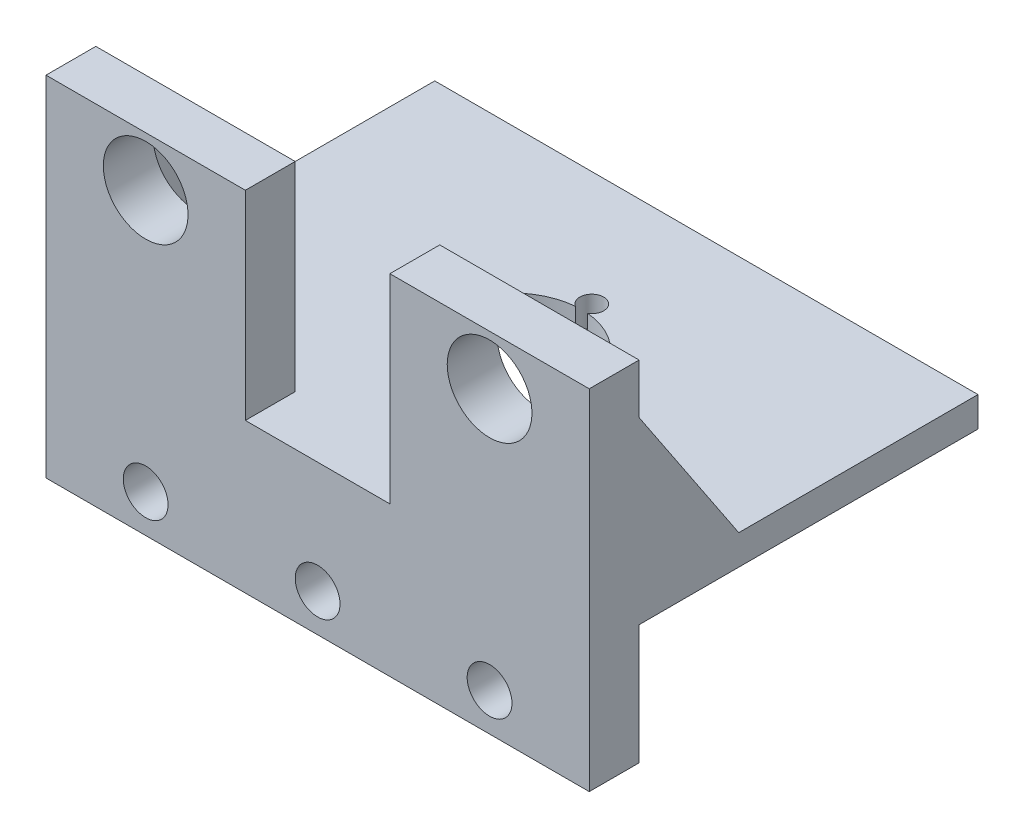
ISO-10303-21;
HEADER;
FILE_DESCRIPTION(('STEP AP214'),'2;1');
FILE_NAME('part.step','',(''),(''),'','','');
FILE_SCHEMA(('AUTOMOTIVE_DESIGN { 1 0 10303 214 1 1 1 1 }'));
ENDSEC;
DATA;
#1=APPLICATION_CONTEXT('core data for automotive mechanical design processes');
#2=APPLICATION_PROTOCOL_DEFINITION('international standard','automotive_design',2000,#1);
#3=PRODUCT_CONTEXT('',#1,'mechanical');
#4=PRODUCT('Part','Part','',(#3));
#5=PRODUCT_RELATED_PRODUCT_CATEGORY('part','',(#4));
#6=PRODUCT_DEFINITION_FORMATION('','',#4);
#7=PRODUCT_DEFINITION_CONTEXT('part definition',#1,'design');
#8=PRODUCT_DEFINITION('design','',#6,#7);
#9=PRODUCT_DEFINITION_SHAPE('','',#8);
#10=(LENGTH_UNIT() NAMED_UNIT(*) SI_UNIT(.MILLI.,.METRE.));
#11=(NAMED_UNIT(*) PLANE_ANGLE_UNIT() SI_UNIT($,.RADIAN.));
#12=(NAMED_UNIT(*) SI_UNIT($,.STERADIAN.) SOLID_ANGLE_UNIT());
#13=UNCERTAINTY_MEASURE_WITH_UNIT(LENGTH_MEASURE(1.E-05),#10,'distance_accuracy_value','');
#14=(GEOMETRIC_REPRESENTATION_CONTEXT(3) GLOBAL_UNCERTAINTY_ASSIGNED_CONTEXT((#13)) GLOBAL_UNIT_ASSIGNED_CONTEXT((#10,
#11,#12)) REPRESENTATION_CONTEXT('',''));
#15=CARTESIAN_POINT('',(0.,0.,0.));
#16=DIRECTION('',(0.,0.,1.));
#17=DIRECTION('',(1.,0.,0.));
#18=AXIS2_PLACEMENT_3D('',#15,#16,#17);
#19=CARTESIAN_POINT('',(0.,3.,0.));
#20=DIRECTION('',(0.,-1.,0.));
#21=DIRECTION('',(0.,0.,-1.));
#22=AXIS2_PLACEMENT_3D('',#19,#20,#21);
#23=PLANE('',#22);
#24=CARTESIAN_POINT('',(-13.3995438408786,3.,-8.1293125841432));
#25=DIRECTION('',(0.,1.,0.));
#26=DIRECTION('',(0.,0.,1.));
#27=AXIS2_PLACEMENT_3D('',#24,#25,#26);
#28=CIRCLE('',#27,7.);
#29=CARTESIAN_POINT('',(-12.7796698617506,3.,-1.15681258414321));
#30=VERTEX_POINT('',#29);
#31=CARTESIAN_POINT('',(-6.42771627711215,3.,-7.50192082367236));
#32=VERTEX_POINT('',#31);
#33=EDGE_CURVE('E343',#30,#32,#28,.T.);
#34=ORIENTED_EDGE('',*,*,#33,.F.);
#35=CARTESIAN_POINT('',(-13.3995438408786,3.,-0.129312584143204));
#36=DIRECTION('',(0.,1.,0.));
#37=DIRECTION('',(0.,0.,1.));
#38=AXIS2_PLACEMENT_3D('',#35,#36,#37);
#39=CIRCLE('',#38,1.19999999999999);
#40=CARTESIAN_POINT('',(-14.0194178200066,3.,-1.1568125841432));
#41=VERTEX_POINT('',#40);
#42=EDGE_CURVE('E321',#41,#30,#39,.T.);
#43=ORIENTED_EDGE('',*,*,#42,.F.);
#44=CARTESIAN_POINT('',(-20.371371404645,3.,-7.50192082367236));
#45=VERTEX_POINT('',#44);
#46=EDGE_CURVE('E342',#45,#41,#28,.T.);
#47=ORIENTED_EDGE('',*,*,#46,.F.);
#48=CARTESIAN_POINT('',(-21.3942983711941,3.,-8.12931258414321));
#49=DIRECTION('',(0.,1.,0.));
#50=DIRECTION('',(0.,0.,1.));
#51=AXIS2_PLACEMENT_3D('',#48,#49,#50);
#52=CIRCLE('',#51,1.19999999999999);
#53=CARTESIAN_POINT('',(-20.371371404645,3.,-8.75670434461405));
#54=VERTEX_POINT('',#53);
#55=EDGE_CURVE('E329',#54,#45,#52,.T.);
#56=ORIENTED_EDGE('',*,*,#55,.F.);
#57=CARTESIAN_POINT('',(-14.0194178200066,3.,-15.1018125841432));
#58=VERTEX_POINT('',#57);
#59=EDGE_CURVE('E338',#58,#54,#28,.T.);
#60=ORIENTED_EDGE('',*,*,#59,.F.);
#61=CARTESIAN_POINT('',(-13.3995438408786,3.,-16.1293125841432));
#62=DIRECTION('',(0.,1.,0.));
#63=DIRECTION('',(0.,0.,1.));
#64=AXIS2_PLACEMENT_3D('',#61,#62,#63);
#65=CIRCLE('',#64,1.19999999999999);
#66=CARTESIAN_POINT('',(-12.7796698617506,3.,-15.1018125841432));
#67=VERTEX_POINT('',#66);
#68=EDGE_CURVE('E333',#67,#58,#65,.T.);
#69=ORIENTED_EDGE('',*,*,#68,.F.);
#70=CARTESIAN_POINT('',(-6.42771627711215,3.,-8.75670434461405));
#71=VERTEX_POINT('',#70);
#72=EDGE_CURVE('E337',#71,#67,#28,.T.);
#73=ORIENTED_EDGE('',*,*,#72,.F.);
#74=CARTESIAN_POINT('',(-5.40478931056309,3.,-8.12931258414321));
#75=DIRECTION('',(0.,1.,0.));
#76=DIRECTION('',(0.,0.,1.));
#77=AXIS2_PLACEMENT_3D('',#74,#75,#76);
#78=CIRCLE('',#77,1.19999999999999);
#79=EDGE_CURVE('E325',#32,#71,#78,.T.);
#80=ORIENTED_EDGE('',*,*,#79,.F.);
#81=EDGE_LOOP('',(#34,#43,#47,#56,#60,#69,#73,#80));
#82=FACE_BOUND('',#81,.T.);
#83=DIRECTION('',(0.,0.,1.));
#84=VECTOR('',#83,1.);
#85=CARTESIAN_POINT('',(-40.6495438408786,3.,11.3706874158568));
#86=LINE('',#85,#84);
#87=CARTESIAN_POINT('',(-40.6495438408786,3.,-27.6293125841432));
#88=VERTEX_POINT('',#87);
#89=CARTESIAN_POINT('',(-40.6495438408786,3.,-3.62931258414321));
#90=VERTEX_POINT('',#89);
#91=EDGE_CURVE('E53',#88,#90,#86,.T.);
#92=ORIENTED_EDGE('',*,*,#91,.T.);
#93=DIRECTION('',(1.,0.,0.));
#94=VECTOR('',#93,1.);
#95=CARTESIAN_POINT('',(0.,3.,-3.62931258414321));
#96=LINE('',#95,#94);
#97=CARTESIAN_POINT('',(-35.6495438408786,3.,-3.62931258414321));
#98=VERTEX_POINT('',#97);
#99=EDGE_CURVE('E48',#90,#98,#96,.T.);
#100=ORIENTED_EDGE('',*,*,#99,.T.);
#101=DIRECTION('',(0.,0.,-1.));
#102=VECTOR('',#101,1.);
#103=CARTESIAN_POINT('',(-35.6495438408786,3.,0.));
#104=LINE('',#103,#102);
#105=CARTESIAN_POINT('',(-35.6495438408786,3.,6.3706874158568));
#106=VERTEX_POINT('',#105);
#107=EDGE_CURVE('E205',#106,#98,#104,.T.);
#108=ORIENTED_EDGE('',*,*,#107,.F.);
#109=DIRECTION('',(-1.,0.,0.));
#110=VECTOR('',#109,1.);
#111=CARTESIAN_POINT('',(-40.6495438408786,3.,6.3706874158568));
#112=LINE('',#111,#110);
#113=CARTESIAN_POINT('',(-20.6495438408786,3.,6.3706874158568));
#114=VERTEX_POINT('',#113);
#115=EDGE_CURVE('E192',#114,#106,#112,.T.);
#116=ORIENTED_EDGE('',*,*,#115,.F.);
#117=DIRECTION('',(0.,0.,-1.));
#118=VECTOR('',#117,1.);
#119=CARTESIAN_POINT('',(-20.6495438408786,3.,11.3706874158568));
#120=LINE('',#119,#118);
#121=CARTESIAN_POINT('',(-20.6495438408786,3.,11.3706874158568));
#122=VERTEX_POINT('',#121);
#123=EDGE_CURVE('E203',#122,#114,#120,.T.);
#124=ORIENTED_EDGE('',*,*,#123,.F.);
#125=DIRECTION('',(1.,0.,0.));
#126=VECTOR('',#125,1.);
#127=CARTESIAN_POINT('',(-40.6495438408786,3.,11.3706874158568));
#128=LINE('',#127,#126);
#129=CARTESIAN_POINT('',(-6.14954384087858,3.,11.3706874158568));
#130=VERTEX_POINT('',#129);
#131=EDGE_CURVE('E345',#122,#130,#128,.T.);
#132=ORIENTED_EDGE('',*,*,#131,.T.);
#133=DIRECTION('',(0.,0.,1.));
#134=VECTOR('',#133,1.);
#135=CARTESIAN_POINT('',(-6.14954384087857,3.,11.3706874158568));
#136=LINE('',#135,#134);
#137=CARTESIAN_POINT('',(-6.14954384087857,3.,6.3706874158568));
#138=VERTEX_POINT('',#137);
#139=EDGE_CURVE('E304',#138,#130,#136,.T.);
#140=ORIENTED_EDGE('',*,*,#139,.F.);
#141=DIRECTION('',(-1.,0.,0.));
#142=VECTOR('',#141,1.);
#143=CARTESIAN_POINT('',(13.8504561591214,3.,6.3706874158568));
#144=LINE('',#143,#142);
#145=CARTESIAN_POINT('',(8.85045615912142,3.,6.3706874158568));
#146=VERTEX_POINT('',#145);
#147=EDGE_CURVE('E300',#146,#138,#144,.T.);
#148=ORIENTED_EDGE('',*,*,#147,.F.);
#149=DIRECTION('',(0.,0.,1.));
#150=VECTOR('',#149,1.);
#151=CARTESIAN_POINT('',(8.85045615912142,3.,0.));
#152=LINE('',#151,#150);
#153=CARTESIAN_POINT('',(8.85045615912142,3.,-3.62931258414321));
#154=VERTEX_POINT('',#153);
#155=EDGE_CURVE('E230',#154,#146,#152,.T.);
#156=ORIENTED_EDGE('',*,*,#155,.F.);
#157=DIRECTION('',(-1.,0.,0.));
#158=VECTOR('',#157,1.);
#159=CARTESIAN_POINT('',(0.,3.,-3.6293125841432));
#160=LINE('',#159,#158);
#161=CARTESIAN_POINT('',(13.8504561591214,3.,-3.6293125841432));
#162=VERTEX_POINT('',#161);
#163=EDGE_CURVE('E235',#154,#162,#160,.F.);
#164=ORIENTED_EDGE('',*,*,#163,.T.);
#165=DIRECTION('',(0.,0.,-1.));
#166=VECTOR('',#165,1.);
#167=CARTESIAN_POINT('',(13.8504561591214,3.,11.3706874158568));
#168=LINE('',#167,#166);
#169=CARTESIAN_POINT('',(13.8504561591214,3.,-27.6293125841432));
#170=VERTEX_POINT('',#169);
#171=EDGE_CURVE('E348',#162,#170,#168,.T.);
#172=ORIENTED_EDGE('',*,*,#171,.T.);
#173=DIRECTION('',(-1.,0.,0.));
#174=VECTOR('',#173,1.);
#175=CARTESIAN_POINT('',(-40.6495438408786,3.,-27.6293125841432));
#176=LINE('',#175,#174);
#177=EDGE_CURVE('E350',#170,#88,#176,.T.);
#178=ORIENTED_EDGE('',*,*,#177,.T.);
#179=EDGE_LOOP('',(#92,#100,#108,#116,#124,#132,#140,#148,#156,#164,#172,#178));
#180=FACE_BOUND('',#179,.T.);
#181=ADVANCED_FACE('F33',(#82,#180),#23,.F.);
#182=CARTESIAN_POINT('',(-13.3995438408786,-2.,-8.1293125841432));
#183=DIRECTION('',(0.,1.,0.));
#184=DIRECTION('',(0.,0.,1.));
#185=AXIS2_PLACEMENT_3D('',#182,#183,#184);
#186=CYLINDRICAL_SURFACE('',#185,7.);
#187=CARTESIAN_POINT('',(-13.3995438408786,0.,-8.1293125841432));
#188=DIRECTION('',(0.,-1.,0.));
#189=DIRECTION('',(0.,0.,-1.));
#190=AXIS2_PLACEMENT_3D('',#187,#188,#189);
#191=CIRCLE('',#190,7.);
#192=CARTESIAN_POINT('',(-6.42771627711215,0.,-7.50192082367236));
#193=VERTEX_POINT('',#192);
#194=CARTESIAN_POINT('',(-12.7796698617506,0.,-1.1568125841432));
#195=VERTEX_POINT('',#194);
#196=EDGE_CURVE('E372',#193,#195,#191,.T.);
#197=ORIENTED_EDGE('',*,*,#196,.T.);
#198=DIRECTION('',(0.,1.,0.));
#199=VECTOR('',#198,1.);
#200=CARTESIAN_POINT('',(-12.7796698617506,-5.5,-1.15681258414321));
#201=LINE('',#200,#199);
#202=EDGE_CURVE('E11',#195,#30,#201,.T.);
#203=ORIENTED_EDGE('',*,*,#202,.T.);
#204=ORIENTED_EDGE('',*,*,#33,.T.);
#205=DIRECTION('',(0.,1.,0.));
#206=VECTOR('',#205,1.);
#207=CARTESIAN_POINT('',(-6.42771627711215,-5.5,-7.50192082367236));
#208=LINE('',#207,#206);
#209=EDGE_CURVE('E385',#32,#193,#208,.F.);
#210=ORIENTED_EDGE('',*,*,#209,.T.);
#211=EDGE_LOOP('',(#197,#203,#204,#210));
#212=FACE_BOUND('',#211,.T.);
#213=ADVANCED_FACE('F438',(#212),#186,.F.);
#214=CARTESIAN_POINT('',(-12.7796698617506,0.,-15.1018125841432));
#215=VERTEX_POINT('',#214);
#216=CARTESIAN_POINT('',(-6.42771627711215,0.,-8.75670434461405));
#217=VERTEX_POINT('',#216);
#218=EDGE_CURVE('E356',#215,#217,#191,.T.);
#219=ORIENTED_EDGE('',*,*,#218,.T.);
#220=DIRECTION('',(0.,1.,0.));
#221=VECTOR('',#220,1.);
#222=CARTESIAN_POINT('',(-6.42771627711215,-5.5,-8.75670434461405));
#223=LINE('',#222,#221);
#224=EDGE_CURVE('E388',#217,#71,#223,.T.);
#225=ORIENTED_EDGE('',*,*,#224,.T.);
#226=ORIENTED_EDGE('',*,*,#72,.T.);
#227=DIRECTION('',(0.,1.,0.));
#228=VECTOR('',#227,1.);
#229=CARTESIAN_POINT('',(-12.7796698617506,-5.5,-15.1018125841432));
#230=LINE('',#229,#228);
#231=EDGE_CURVE('E369',#67,#215,#230,.F.);
#232=ORIENTED_EDGE('',*,*,#231,.T.);
#233=EDGE_LOOP('',(#219,#225,#226,#232));
#234=FACE_BOUND('',#233,.T.);
#235=ADVANCED_FACE('F418',(#234),#186,.F.);
#236=ORIENTED_EDGE('',*,*,#46,.T.);
#237=DIRECTION('',(0.,1.,0.));
#238=VECTOR('',#237,1.);
#239=CARTESIAN_POINT('',(-14.0194178200066,-5.5,-1.15681258414321));
#240=LINE('',#239,#238);
#241=CARTESIAN_POINT('',(-14.0194178200066,0.,-1.1568125841432));
#242=VERTEX_POINT('',#241);
#243=EDGE_CURVE('E41',#41,#242,#240,.F.);
#244=ORIENTED_EDGE('',*,*,#243,.T.);
#245=CARTESIAN_POINT('',(-20.371371404645,0.,-7.50192082367236));
#246=VERTEX_POINT('',#245);
#247=EDGE_CURVE('E373',#242,#246,#191,.T.);
#248=ORIENTED_EDGE('',*,*,#247,.T.);
#249=DIRECTION('',(0.,1.,0.));
#250=VECTOR('',#249,1.);
#251=CARTESIAN_POINT('',(-20.371371404645,-5.5,-7.50192082367236));
#252=LINE('',#251,#250);
#253=EDGE_CURVE('E382',#246,#45,#252,.T.);
#254=ORIENTED_EDGE('',*,*,#253,.T.);
#255=EDGE_LOOP('',(#236,#244,#248,#254));
#256=FACE_BOUND('',#255,.T.);
#257=ADVANCED_FACE('F394',(#256),#186,.F.);
#258=CARTESIAN_POINT('',(-40.6495438408786,3.,11.3706874158568));
#259=DIRECTION('',(1.,0.,0.));
#260=DIRECTION('',(0.,0.,-1.));
#261=AXIS2_PLACEMENT_3D('',#258,#259,#260);
#262=PLANE('',#261);
#263=DIRECTION('',(0.,-1.,0.));
#264=VECTOR('',#263,1.);
#265=CARTESIAN_POINT('',(-40.6495438408786,3.,11.3706874158568));
#266=LINE('',#265,#264);
#267=CARTESIAN_POINT('',(-40.6495438408786,23.,11.3706874158568));
#268=VERTEX_POINT('',#267);
#269=CARTESIAN_POINT('',(-40.6495438408786,-12.,11.3706874158568));
#270=VERTEX_POINT('',#269);
#271=EDGE_CURVE('E366',#268,#270,#266,.T.);
#272=ORIENTED_EDGE('',*,*,#271,.F.);
#273=DIRECTION('',(0.,0.,1.));
#274=VECTOR('',#273,1.);
#275=CARTESIAN_POINT('',(-40.6495438408786,23.,11.3706874158568));
#276=LINE('',#275,#274);
#277=CARTESIAN_POINT('',(-40.6495438408786,23.,6.3706874158568));
#278=VERTEX_POINT('',#277);
#279=EDGE_CURVE('E202',#278,#268,#276,.T.);
#280=ORIENTED_EDGE('',*,*,#279,.F.);
#281=DIRECTION('',(0.,-1.,0.));
#282=VECTOR('',#281,1.);
#283=CARTESIAN_POINT('',(-40.6495438408786,23.,6.3706874158568));
#284=LINE('',#283,#282);
#285=CARTESIAN_POINT('',(-40.6495438408786,18.,6.3706874158568));
#286=VERTEX_POINT('',#285);
#287=EDGE_CURVE('E292',#278,#286,#284,.T.);
#288=ORIENTED_EDGE('',*,*,#287,.T.);
#289=DIRECTION('',(0.,-0.832050294337844,-0.554700196225229));
#290=VECTOR('',#289,1.);
#291=CARTESIAN_POINT('',(-40.6495438408786,18.,6.3706874158568));
#292=LINE('',#291,#290);
#293=EDGE_CURVE('E213',#286,#90,#292,.T.);
#294=ORIENTED_EDGE('',*,*,#293,.T.);
#295=ORIENTED_EDGE('',*,*,#91,.F.);
#296=DIRECTION('',(0.,-1.,0.));
#297=VECTOR('',#296,1.);
#298=CARTESIAN_POINT('',(-40.6495438408786,3.,-27.6293125841432));
#299=LINE('',#298,#297);
#300=CARTESIAN_POINT('',(-40.6495438408786,0.,-27.6293125841432));
#301=VERTEX_POINT('',#300);
#302=EDGE_CURVE('E352',#88,#301,#299,.T.);
#303=ORIENTED_EDGE('',*,*,#302,.T.);
#304=DIRECTION('',(0.,0.,1.));
#305=VECTOR('',#304,1.);
#306=CARTESIAN_POINT('',(-40.6495438408786,0.,11.3706874158568));
#307=LINE('',#306,#305);
#308=CARTESIAN_POINT('',(-40.6495438408786,0.,6.3706874158568));
#309=VERTEX_POINT('',#308);
#310=EDGE_CURVE('E353',#301,#309,#307,.T.);
#311=ORIENTED_EDGE('',*,*,#310,.T.);
#312=DIRECTION('',(0.,1.,0.));
#313=VECTOR('',#312,1.);
#314=CARTESIAN_POINT('',(-40.6495438408786,-12.,6.3706874158568));
#315=LINE('',#314,#313);
#316=CARTESIAN_POINT('',(-40.6495438408786,-12.,6.3706874158568));
#317=VERTEX_POINT('',#316);
#318=EDGE_CURVE('E270',#317,#309,#315,.T.);
#319=ORIENTED_EDGE('',*,*,#318,.F.);
#320=DIRECTION('',(0.,0.,-1.));
#321=VECTOR('',#320,1.);
#322=CARTESIAN_POINT('',(-40.6495438408786,-12.,11.3706874158568));
#323=LINE('',#322,#321);
#324=EDGE_CURVE('E256',#270,#317,#323,.T.);
#325=ORIENTED_EDGE('',*,*,#324,.F.);
#326=EDGE_LOOP('',(#272,#280,#288,#294,#295,#303,#311,#319,#325));
#327=FACE_BOUND('',#326,.T.);
#328=ADVANCED_FACE('F35',(#327),#262,.F.);
#329=CARTESIAN_POINT('',(-40.6495438408786,3.,11.3706874158568));
#330=DIRECTION('',(0.,0.,-1.));
#331=DIRECTION('',(-1.,0.,0.));
#332=AXIS2_PLACEMENT_3D('',#329,#330,#331);
#333=PLANE('',#332);
#334=ORIENTED_EDGE('',*,*,#271,.T.);
#335=DIRECTION('',(-1.,0.,0.));
#336=VECTOR('',#335,1.);
#337=CARTESIAN_POINT('',(-40.6495438408786,-12.,11.3706874158568));
#338=LINE('',#337,#336);
#339=CARTESIAN_POINT('',(13.8504561591214,-12.,11.3706874158568));
#340=VERTEX_POINT('',#339);
#341=EDGE_CURVE('E264',#340,#270,#338,.T.);
#342=ORIENTED_EDGE('',*,*,#341,.F.);
#343=DIRECTION('',(0.,-1.,0.));
#344=VECTOR('',#343,1.);
#345=CARTESIAN_POINT('',(13.8504561591214,3.,11.3706874158568));
#346=LINE('',#345,#344);
#347=CARTESIAN_POINT('',(13.8504561591214,23.,11.3706874158568));
#348=VERTEX_POINT('',#347);
#349=EDGE_CURVE('E364',#348,#340,#346,.T.);
#350=ORIENTED_EDGE('',*,*,#349,.F.);
#351=DIRECTION('',(1.,0.,0.));
#352=VECTOR('',#351,1.);
#353=CARTESIAN_POINT('',(13.8504561591214,23.,11.3706874158568));
#354=LINE('',#353,#352);
#355=CARTESIAN_POINT('',(-6.14954384087857,23.,11.3706874158568));
#356=VERTEX_POINT('',#355);
#357=EDGE_CURVE('E308',#356,#348,#354,.T.);
#358=ORIENTED_EDGE('',*,*,#357,.F.);
#359=DIRECTION('',(0.,-1.,0.));
#360=VECTOR('',#359,1.);
#361=CARTESIAN_POINT('',(-6.14954384087857,23.,11.3706874158568));
#362=LINE('',#361,#360);
#363=EDGE_CURVE('E310',#356,#130,#362,.T.);
#364=ORIENTED_EDGE('',*,*,#363,.T.);
#365=ORIENTED_EDGE('',*,*,#131,.F.);
#366=DIRECTION('',(0.,-1.,0.));
#367=VECTOR('',#366,1.);
#368=CARTESIAN_POINT('',(-20.6495438408786,23.,11.3706874158568));
#369=LINE('',#368,#367);
#370=CARTESIAN_POINT('',(-20.6495438408786,23.,11.3706874158568));
#371=VERTEX_POINT('',#370);
#372=EDGE_CURVE('E297',#371,#122,#369,.T.);
#373=ORIENTED_EDGE('',*,*,#372,.F.);
#374=DIRECTION('',(1.,0.,0.));
#375=VECTOR('',#374,1.);
#376=CARTESIAN_POINT('',(-40.6495438408786,23.,11.3706874158568));
#377=LINE('',#376,#375);
#378=EDGE_CURVE('E286',#268,#371,#377,.T.);
#379=ORIENTED_EDGE('',*,*,#378,.F.);
#380=EDGE_LOOP('',(#334,#342,#350,#358,#364,#365,#373,#379));
#381=FACE_BOUND('',#380,.T.);
#382=CARTESIAN_POINT('',(-30.6495438408786,-8.2,11.3706874158568));
#383=DIRECTION('',(0.,0.,1.));
#384=DIRECTION('',(1.,0.,0.));
#385=AXIS2_PLACEMENT_3D('',#382,#383,#384);
#386=CIRCLE('',#385,2.24789999999999);
#387=CARTESIAN_POINT('',(-28.4016438408786,-8.2,11.3706874158568));
#388=VERTEX_POINT('',#387);
#389=EDGE_CURVE('E237',#388,#388,#386,.T.);
#390=ORIENTED_EDGE('',*,*,#389,.F.);
#391=EDGE_LOOP('',(#390));
#392=FACE_BOUND('',#391,.T.);
#393=CARTESIAN_POINT('',(-13.3995438408786,-8.2,11.3706874158568));
#394=DIRECTION('',(0.,0.,1.));
#395=DIRECTION('',(1.,0.,0.));
#396=AXIS2_PLACEMENT_3D('',#393,#394,#395);
#397=CIRCLE('',#396,2.24789999999999);
#398=CARTESIAN_POINT('',(-11.1516438408786,-8.2,11.3706874158568));
#399=VERTEX_POINT('',#398);
#400=EDGE_CURVE('E243',#399,#399,#397,.T.);
#401=ORIENTED_EDGE('',*,*,#400,.F.);
#402=EDGE_LOOP('',(#401));
#403=FACE_BOUND('',#402,.T.);
#404=CARTESIAN_POINT('',(3.85045615912143,-8.2,11.3706874158568));
#405=DIRECTION('',(0.,0.,1.));
#406=DIRECTION('',(1.,0.,0.));
#407=AXIS2_PLACEMENT_3D('',#404,#405,#406);
#408=CIRCLE('',#407,2.24789999999999);
#409=CARTESIAN_POINT('',(6.09835615912141,-8.2,11.3706874158568));
#410=VERTEX_POINT('',#409);
#411=EDGE_CURVE('E249',#410,#410,#408,.T.);
#412=ORIENTED_EDGE('',*,*,#411,.F.);
#413=EDGE_LOOP('',(#412));
#414=FACE_BOUND('',#413,.T.);
#415=CARTESIAN_POINT('',(3.85045615912143,18.,11.3706874158568));
#416=DIRECTION('',(0.,0.,-1.));
#417=DIRECTION('',(-1.,0.,0.));
#418=AXIS2_PLACEMENT_3D('',#415,#416,#417);
#419=CIRCLE('',#418,4.25);
#420=CARTESIAN_POINT('',(-0.399543840878573,18.,11.3706874158568));
#421=VERTEX_POINT('',#420);
#422=EDGE_CURVE('E274',#421,#421,#419,.T.);
#423=ORIENTED_EDGE('',*,*,#422,.T.);
#424=EDGE_LOOP('',(#423));
#425=FACE_BOUND('',#424,.T.);
#426=CARTESIAN_POINT('',(-30.6495438408786,18.,11.3706874158568));
#427=DIRECTION('',(0.,0.,-1.));
#428=DIRECTION('',(-1.,0.,0.));
#429=AXIS2_PLACEMENT_3D('',#426,#427,#428);
#430=CIRCLE('',#429,4.25);
#431=CARTESIAN_POINT('',(-34.8995438408786,18.,11.3706874158568));
#432=VERTEX_POINT('',#431);
#433=EDGE_CURVE('E280',#432,#432,#430,.T.);
#434=ORIENTED_EDGE('',*,*,#433,.T.);
#435=EDGE_LOOP('',(#434));
#436=FACE_BOUND('',#435,.T.);
#437=ADVANCED_FACE('F455',(#381,#392,#403,#414,#425,#436),#333,.F.);
#438=CARTESIAN_POINT('',(13.8504561591214,3.,11.3706874158568));
#439=DIRECTION('',(-1.,0.,0.));
#440=DIRECTION('',(0.,0.,1.));
#441=AXIS2_PLACEMENT_3D('',#438,#439,#440);
#442=PLANE('',#441);
#443=ORIENTED_EDGE('',*,*,#171,.F.);
#444=DIRECTION('',(0.,-0.832050294337844,-0.554700196225229));
#445=VECTOR('',#444,1.);
#446=CARTESIAN_POINT('',(13.8504561591214,18.,6.3706874158568));
#447=LINE('',#446,#445);
#448=CARTESIAN_POINT('',(13.8504561591214,18.,6.3706874158568));
#449=VERTEX_POINT('',#448);
#450=EDGE_CURVE('E222',#449,#162,#447,.T.);
#451=ORIENTED_EDGE('',*,*,#450,.F.);
#452=DIRECTION('',(0.,-1.,0.));
#453=VECTOR('',#452,1.);
#454=CARTESIAN_POINT('',(13.8504561591214,23.,6.3706874158568));
#455=LINE('',#454,#453);
#456=CARTESIAN_POINT('',(13.8504561591214,23.,6.3706874158568));
#457=VERTEX_POINT('',#456);
#458=EDGE_CURVE('E319',#457,#449,#455,.T.);
#459=ORIENTED_EDGE('',*,*,#458,.F.);
#460=DIRECTION('',(0.,0.,-1.));
#461=VECTOR('',#460,1.);
#462=CARTESIAN_POINT('',(13.8504561591214,23.,11.3706874158568));
#463=LINE('',#462,#461);
#464=EDGE_CURVE('E301',#348,#457,#463,.T.);
#465=ORIENTED_EDGE('',*,*,#464,.F.);
#466=ORIENTED_EDGE('',*,*,#349,.T.);
#467=DIRECTION('',(0.,0.,1.));
#468=VECTOR('',#467,1.);
#469=CARTESIAN_POINT('',(13.8504561591214,-12.,11.3706874158568));
#470=LINE('',#469,#468);
#471=CARTESIAN_POINT('',(13.8504561591214,-12.,6.3706874158568));
#472=VERTEX_POINT('',#471);
#473=EDGE_CURVE('E261',#472,#340,#470,.T.);
#474=ORIENTED_EDGE('',*,*,#473,.F.);
#475=DIRECTION('',(0.,1.,0.));
#476=VECTOR('',#475,1.);
#477=CARTESIAN_POINT('',(13.8504561591214,-12.,6.3706874158568));
#478=LINE('',#477,#476);
#479=CARTESIAN_POINT('',(13.8504561591214,0.,6.3706874158568));
#480=VERTEX_POINT('',#479);
#481=EDGE_CURVE('E266',#472,#480,#478,.T.);
#482=ORIENTED_EDGE('',*,*,#481,.T.);
#483=DIRECTION('',(0.,0.,-1.));
#484=VECTOR('',#483,1.);
#485=CARTESIAN_POINT('',(13.8504561591214,0.,11.3706874158568));
#486=LINE('',#485,#484);
#487=CARTESIAN_POINT('',(13.8504561591214,0.,-27.6293125841432));
#488=VERTEX_POINT('',#487);
#489=EDGE_CURVE('E355',#480,#488,#486,.T.);
#490=ORIENTED_EDGE('',*,*,#489,.T.);
#491=DIRECTION('',(0.,-1.,0.));
#492=VECTOR('',#491,1.);
#493=CARTESIAN_POINT('',(13.8504561591214,3.,-27.6293125841432));
#494=LINE('',#493,#492);
#495=EDGE_CURVE('E361',#170,#488,#494,.T.);
#496=ORIENTED_EDGE('',*,*,#495,.F.);
#497=EDGE_LOOP('',(#443,#451,#459,#465,#466,#474,#482,#490,#496));
#498=FACE_BOUND('',#497,.T.);
#499=ADVANCED_FACE('F452',(#498),#442,.F.);
#500=CARTESIAN_POINT('',(-40.6495438408786,3.,-27.6293125841432));
#501=DIRECTION('',(0.,0.,1.));
#502=DIRECTION('',(1.,0.,0.));
#503=AXIS2_PLACEMENT_3D('',#500,#501,#502);
#504=PLANE('',#503);
#505=DIRECTION('',(-1.,0.,0.));
#506=VECTOR('',#505,1.);
#507=CARTESIAN_POINT('',(-40.6495438408786,0.,-27.6293125841432));
#508=LINE('',#507,#506);
#509=EDGE_CURVE('E346',#488,#301,#508,.T.);
#510=ORIENTED_EDGE('',*,*,#509,.T.);
#511=ORIENTED_EDGE('',*,*,#302,.F.);
#512=ORIENTED_EDGE('',*,*,#177,.F.);
#513=ORIENTED_EDGE('',*,*,#495,.T.);
#514=EDGE_LOOP('',(#510,#511,#512,#513));
#515=FACE_BOUND('',#514,.T.);
#516=ADVANCED_FACE('F448',(#515),#504,.F.);
#517=CARTESIAN_POINT('',(0.,0.,0.));
#518=DIRECTION('',(0.,-1.,0.));
#519=DIRECTION('',(0.,0.,-1.));
#520=AXIS2_PLACEMENT_3D('',#517,#518,#519);
#521=PLANE('',#520);
#522=DIRECTION('',(1.,0.,0.));
#523=VECTOR('',#522,1.);
#524=CARTESIAN_POINT('',(-40.6495438408786,0.,6.3706874158568));
#525=LINE('',#524,#523);
#526=EDGE_CURVE('E255',#309,#480,#525,.T.);
#527=ORIENTED_EDGE('',*,*,#526,.F.);
#528=ORIENTED_EDGE('',*,*,#310,.F.);
#529=ORIENTED_EDGE('',*,*,#509,.F.);
#530=ORIENTED_EDGE('',*,*,#489,.F.);
#531=EDGE_LOOP('',(#527,#528,#529,#530));
#532=FACE_BOUND('',#531,.T.);
#533=CARTESIAN_POINT('',(-13.3995438408786,0.,-0.129312584143204));
#534=DIRECTION('',(0.,-1.,0.));
#535=DIRECTION('',(0.,0.,-1.));
#536=AXIS2_PLACEMENT_3D('',#533,#534,#535);
#537=CIRCLE('',#536,1.19999999999999);
#538=EDGE_CURVE('E323',#195,#242,#537,.T.);
#539=ORIENTED_EDGE('',*,*,#538,.F.);
#540=ORIENTED_EDGE('',*,*,#196,.F.);
#541=CARTESIAN_POINT('',(-5.40478931056309,0.,-8.12931258414321));
#542=DIRECTION('',(0.,-1.,0.));
#543=DIRECTION('',(0.,0.,-1.));
#544=AXIS2_PLACEMENT_3D('',#541,#542,#543);
#545=CIRCLE('',#544,1.19999999999999);
#546=EDGE_CURVE('E327',#217,#193,#545,.T.);
#547=ORIENTED_EDGE('',*,*,#546,.F.);
#548=ORIENTED_EDGE('',*,*,#218,.F.);
#549=CARTESIAN_POINT('',(-13.3995438408786,0.,-16.1293125841432));
#550=DIRECTION('',(0.,-1.,0.));
#551=DIRECTION('',(0.,0.,-1.));
#552=AXIS2_PLACEMENT_3D('',#549,#550,#551);
#553=CIRCLE('',#552,1.19999999999999);
#554=CARTESIAN_POINT('',(-14.0194178200066,0.,-15.1018125841432));
#555=VERTEX_POINT('',#554);
#556=EDGE_CURVE('E335',#555,#215,#553,.T.);
#557=ORIENTED_EDGE('',*,*,#556,.F.);
#558=CARTESIAN_POINT('',(-20.371371404645,0.,-8.75670434461405));
#559=VERTEX_POINT('',#558);
#560=EDGE_CURVE('E341',#559,#555,#191,.T.);
#561=ORIENTED_EDGE('',*,*,#560,.F.);
#562=CARTESIAN_POINT('',(-21.3942983711941,0.,-8.12931258414321));
#563=DIRECTION('',(0.,-1.,0.));
#564=DIRECTION('',(0.,0.,-1.));
#565=AXIS2_PLACEMENT_3D('',#562,#563,#564);
#566=CIRCLE('',#565,1.19999999999999);
#567=EDGE_CURVE('E331',#246,#559,#566,.T.);
#568=ORIENTED_EDGE('',*,*,#567,.F.);
#569=ORIENTED_EDGE('',*,*,#247,.F.);
#570=EDGE_LOOP('',(#539,#540,#547,#548,#557,#561,#568,#569));
#571=FACE_BOUND('',#570,.T.);
#572=ADVANCED_FACE('F402',(#532,#571),#521,.T.);
#573=ORIENTED_EDGE('',*,*,#59,.T.);
#574=DIRECTION('',(0.,1.,0.));
#575=VECTOR('',#574,1.);
#576=CARTESIAN_POINT('',(-20.371371404645,-5.5,-8.75670434461405));
#577=LINE('',#576,#575);
#578=EDGE_CURVE('E379',#54,#559,#577,.F.);
#579=ORIENTED_EDGE('',*,*,#578,.T.);
#580=ORIENTED_EDGE('',*,*,#560,.T.);
#581=DIRECTION('',(0.,1.,0.));
#582=VECTOR('',#581,1.);
#583=CARTESIAN_POINT('',(-14.0194178200066,-5.5,-15.1018125841432));
#584=LINE('',#583,#582);
#585=EDGE_CURVE('E376',#555,#58,#584,.T.);
#586=ORIENTED_EDGE('',*,*,#585,.T.);
#587=EDGE_LOOP('',(#573,#579,#580,#586));
#588=FACE_BOUND('',#587,.T.);
#589=ADVANCED_FACE('F408',(#588),#186,.F.);
#590=CARTESIAN_POINT('',(-13.3995438408786,3.,-16.1293125841432));
#591=DIRECTION('',(0.,1.,0.));
#592=DIRECTION('',(0.,0.,1.));
#593=AXIS2_PLACEMENT_3D('',#590,#591,#592);
#594=CYLINDRICAL_SURFACE('',#593,1.19999999999999);
#595=ORIENTED_EDGE('',*,*,#556,.T.);
#596=ORIENTED_EDGE('',*,*,#231,.F.);
#597=ORIENTED_EDGE('',*,*,#68,.T.);
#598=ORIENTED_EDGE('',*,*,#585,.F.);
#599=EDGE_LOOP('',(#595,#596,#597,#598));
#600=FACE_BOUND('',#599,.T.);
#601=ADVANCED_FACE('F412',(#600),#594,.F.);
#602=CARTESIAN_POINT('',(-21.3942983711941,3.,-8.12931258414321));
#603=DIRECTION('',(0.,1.,0.));
#604=DIRECTION('',(0.,0.,1.));
#605=AXIS2_PLACEMENT_3D('',#602,#603,#604);
#606=CYLINDRICAL_SURFACE('',#605,1.19999999999999);
#607=ORIENTED_EDGE('',*,*,#567,.T.);
#608=ORIENTED_EDGE('',*,*,#578,.F.);
#609=ORIENTED_EDGE('',*,*,#55,.T.);
#610=ORIENTED_EDGE('',*,*,#253,.F.);
#611=EDGE_LOOP('',(#607,#608,#609,#610));
#612=FACE_BOUND('',#611,.T.);
#613=ADVANCED_FACE('F425',(#612),#606,.F.);
#614=CARTESIAN_POINT('',(-5.40478931056309,3.,-8.12931258414321));
#615=DIRECTION('',(0.,1.,0.));
#616=DIRECTION('',(0.,0.,1.));
#617=AXIS2_PLACEMENT_3D('',#614,#615,#616);
#618=CYLINDRICAL_SURFACE('',#617,1.19999999999999);
#619=ORIENTED_EDGE('',*,*,#546,.T.);
#620=ORIENTED_EDGE('',*,*,#209,.F.);
#621=ORIENTED_EDGE('',*,*,#79,.T.);
#622=ORIENTED_EDGE('',*,*,#224,.F.);
#623=EDGE_LOOP('',(#619,#620,#621,#622));
#624=FACE_BOUND('',#623,.T.);
#625=ADVANCED_FACE('F427',(#624),#618,.F.);
#626=CARTESIAN_POINT('',(-13.3995438408786,3.,-0.129312584143204));
#627=DIRECTION('',(0.,1.,0.));
#628=DIRECTION('',(0.,0.,1.));
#629=AXIS2_PLACEMENT_3D('',#626,#627,#628);
#630=CYLINDRICAL_SURFACE('',#629,1.19999999999999);
#631=ORIENTED_EDGE('',*,*,#538,.T.);
#632=ORIENTED_EDGE('',*,*,#243,.F.);
#633=ORIENTED_EDGE('',*,*,#42,.T.);
#634=ORIENTED_EDGE('',*,*,#202,.F.);
#635=EDGE_LOOP('',(#631,#632,#633,#634));
#636=FACE_BOUND('',#635,.T.);
#637=ADVANCED_FACE('F433',(#636),#630,.F.);
#638=CARTESIAN_POINT('',(13.8504561591214,23.,6.3706874158568));
#639=DIRECTION('',(0.,0.,1.));
#640=DIRECTION('',(1.,0.,0.));
#641=AXIS2_PLACEMENT_3D('',#638,#639,#640);
#642=PLANE('',#641);
#643=CARTESIAN_POINT('',(3.85045615912143,18.,6.3706874158568));
#644=DIRECTION('',(0.,0.,-1.));
#645=DIRECTION('',(-1.,0.,0.));
#646=AXIS2_PLACEMENT_3D('',#643,#644,#645);
#647=CIRCLE('',#646,4.25);
#648=CARTESIAN_POINT('',(-0.399543840878575,18.,6.3706874158568));
#649=VERTEX_POINT('',#648);
#650=EDGE_CURVE('E277',#649,#649,#647,.T.);
#651=ORIENTED_EDGE('',*,*,#650,.F.);
#652=EDGE_LOOP('',(#651));
#653=FACE_BOUND('',#652,.T.);
#654=ORIENTED_EDGE('',*,*,#458,.T.);
#655=DIRECTION('',(1.,0.,0.));
#656=VECTOR('',#655,1.);
#657=CARTESIAN_POINT('',(13.8504561591214,18.,6.3706874158568));
#658=LINE('',#657,#656);
#659=CARTESIAN_POINT('',(8.85045615912142,18.,6.3706874158568));
#660=VERTEX_POINT('',#659);
#661=EDGE_CURVE('E233',#449,#660,#658,.F.);
#662=ORIENTED_EDGE('',*,*,#661,.T.);
#663=DIRECTION('',(0.,1.,0.));
#664=VECTOR('',#663,1.);
#665=CARTESIAN_POINT('',(8.85045615912142,23.,6.3706874158568));
#666=LINE('',#665,#664);
#667=EDGE_CURVE('E225',#146,#660,#666,.T.);
#668=ORIENTED_EDGE('',*,*,#667,.F.);
#669=ORIENTED_EDGE('',*,*,#147,.T.);
#670=DIRECTION('',(0.,-1.,0.));
#671=VECTOR('',#670,1.);
#672=CARTESIAN_POINT('',(-6.14954384087857,23.,6.3706874158568));
#673=LINE('',#672,#671);
#674=CARTESIAN_POINT('',(-6.14954384087857,23.,6.3706874158568));
#675=VERTEX_POINT('',#674);
#676=EDGE_CURVE('E316',#675,#138,#673,.T.);
#677=ORIENTED_EDGE('',*,*,#676,.F.);
#678=DIRECTION('',(-1.,0.,0.));
#679=VECTOR('',#678,1.);
#680=CARTESIAN_POINT('',(13.8504561591214,23.,6.3706874158568));
#681=LINE('',#680,#679);
#682=EDGE_CURVE('E303',#457,#675,#681,.T.);
#683=ORIENTED_EDGE('',*,*,#682,.F.);
#684=EDGE_LOOP('',(#654,#662,#668,#669,#677,#683));
#685=FACE_BOUND('',#684,.T.);
#686=ADVANCED_FACE('F505',(#653,#685),#642,.F.);
#687=CARTESIAN_POINT('',(-6.14954384087857,23.,11.3706874158568));
#688=DIRECTION('',(1.,0.,0.));
#689=DIRECTION('',(0.,0.,-1.));
#690=AXIS2_PLACEMENT_3D('',#687,#688,#689);
#691=PLANE('',#690);
#692=ORIENTED_EDGE('',*,*,#139,.T.);
#693=ORIENTED_EDGE('',*,*,#363,.F.);
#694=DIRECTION('',(0.,0.,1.));
#695=VECTOR('',#694,1.);
#696=CARTESIAN_POINT('',(-6.14954384087857,23.,11.3706874158568));
#697=LINE('',#696,#695);
#698=EDGE_CURVE('E306',#675,#356,#697,.T.);
#699=ORIENTED_EDGE('',*,*,#698,.F.);
#700=ORIENTED_EDGE('',*,*,#676,.T.);
#701=EDGE_LOOP('',(#692,#693,#699,#700));
#702=FACE_BOUND('',#701,.T.);
#703=ADVANCED_FACE('F501',(#702),#691,.F.);
#704=CARTESIAN_POINT('',(0.,23.,0.));
#705=DIRECTION('',(0.,1.,0.));
#706=DIRECTION('',(0.,0.,1.));
#707=AXIS2_PLACEMENT_3D('',#704,#705,#706);
#708=PLANE('',#707);
#709=ORIENTED_EDGE('',*,*,#464,.T.);
#710=ORIENTED_EDGE('',*,*,#682,.T.);
#711=ORIENTED_EDGE('',*,*,#698,.T.);
#712=ORIENTED_EDGE('',*,*,#357,.T.);
#713=EDGE_LOOP('',(#709,#710,#711,#712));
#714=FACE_BOUND('',#713,.T.);
#715=ADVANCED_FACE('F495',(#714),#708,.T.);
#716=CARTESIAN_POINT('',(-20.6495438408786,23.,11.3706874158568));
#717=DIRECTION('',(-1.,0.,0.));
#718=DIRECTION('',(0.,0.,1.));
#719=AXIS2_PLACEMENT_3D('',#716,#717,#718);
#720=PLANE('',#719);
#721=ORIENTED_EDGE('',*,*,#123,.T.);
#722=DIRECTION('',(0.,-1.,0.));
#723=VECTOR('',#722,1.);
#724=CARTESIAN_POINT('',(-20.6495438408786,23.,6.3706874158568));
#725=LINE('',#724,#723);
#726=CARTESIAN_POINT('',(-20.6495438408786,23.,6.3706874158568));
#727=VERTEX_POINT('',#726);
#728=EDGE_CURVE('E199',#727,#114,#725,.T.);
#729=ORIENTED_EDGE('',*,*,#728,.F.);
#730=DIRECTION('',(0.,0.,-1.));
#731=VECTOR('',#730,1.);
#732=CARTESIAN_POINT('',(-20.6495438408786,23.,11.3706874158568));
#733=LINE('',#732,#731);
#734=EDGE_CURVE('E288',#371,#727,#733,.T.);
#735=ORIENTED_EDGE('',*,*,#734,.F.);
#736=ORIENTED_EDGE('',*,*,#372,.T.);
#737=EDGE_LOOP('',(#721,#729,#735,#736));
#738=FACE_BOUND('',#737,.T.);
#739=ADVANCED_FACE('F487',(#738),#720,.F.);
#740=CARTESIAN_POINT('',(-40.6495438408786,23.,6.3706874158568));
#741=DIRECTION('',(0.,0.,1.));
#742=DIRECTION('',(1.,0.,0.));
#743=AXIS2_PLACEMENT_3D('',#740,#741,#742);
#744=PLANE('',#743);
#745=CARTESIAN_POINT('',(-30.6495438408786,18.,6.37068741585681));
#746=DIRECTION('',(0.,0.,-1.));
#747=DIRECTION('',(-1.,0.,0.));
#748=AXIS2_PLACEMENT_3D('',#745,#746,#747);
#749=CIRCLE('',#748,4.25);
#750=CARTESIAN_POINT('',(-34.8995438408786,18.,6.37068741585681));
#751=VERTEX_POINT('',#750);
#752=EDGE_CURVE('E273',#751,#751,#749,.T.);
#753=ORIENTED_EDGE('',*,*,#752,.F.);
#754=EDGE_LOOP('',(#753));
#755=FACE_BOUND('',#754,.T.);
#756=DIRECTION('',(0.,-1.,0.));
#757=VECTOR('',#756,1.);
#758=CARTESIAN_POINT('',(-35.6495438408786,23.,6.3706874158568));
#759=LINE('',#758,#757);
#760=CARTESIAN_POINT('',(-35.6495438408786,18.,6.3706874158568));
#761=VERTEX_POINT('',#760);
#762=EDGE_CURVE('E195',#761,#106,#759,.T.);
#763=ORIENTED_EDGE('',*,*,#762,.F.);
#764=DIRECTION('',(-1.,0.,0.));
#765=VECTOR('',#764,1.);
#766=CARTESIAN_POINT('',(-40.6495438408786,18.,6.3706874158568));
#767=LINE('',#766,#765);
#768=EDGE_CURVE('E209',#761,#286,#767,.T.);
#769=ORIENTED_EDGE('',*,*,#768,.T.);
#770=ORIENTED_EDGE('',*,*,#287,.F.);
#771=DIRECTION('',(-1.,0.,0.));
#772=VECTOR('',#771,1.);
#773=CARTESIAN_POINT('',(-40.6495438408786,23.,6.3706874158568));
#774=LINE('',#773,#772);
#775=EDGE_CURVE('E290',#727,#278,#774,.T.);
#776=ORIENTED_EDGE('',*,*,#775,.F.);
#777=ORIENTED_EDGE('',*,*,#728,.T.);
#778=ORIENTED_EDGE('',*,*,#115,.T.);
#779=EDGE_LOOP('',(#763,#769,#770,#776,#777,#778));
#780=FACE_BOUND('',#779,.T.);
#781=ADVANCED_FACE('F193',(#755,#780),#744,.F.);
#782=CARTESIAN_POINT('',(0.,23.,0.));
#783=DIRECTION('',(0.,-1.,0.));
#784=DIRECTION('',(0.,0.,-1.));
#785=AXIS2_PLACEMENT_3D('',#782,#783,#784);
#786=PLANE('',#785);
#787=ORIENTED_EDGE('',*,*,#279,.T.);
#788=ORIENTED_EDGE('',*,*,#378,.T.);
#789=ORIENTED_EDGE('',*,*,#734,.T.);
#790=ORIENTED_EDGE('',*,*,#775,.T.);
#791=EDGE_LOOP('',(#787,#788,#789,#790));
#792=FACE_BOUND('',#791,.T.);
#793=ADVANCED_FACE('F482',(#792),#786,.F.);
#794=CARTESIAN_POINT('',(-30.6495438408786,18.,11.3706874158568));
#795=DIRECTION('',(0.,0.,-1.));
#796=DIRECTION('',(-1.,0.,0.));
#797=AXIS2_PLACEMENT_3D('',#794,#795,#796);
#798=CYLINDRICAL_SURFACE('',#797,4.25);
#799=ORIENTED_EDGE('',*,*,#433,.F.);
#800=EDGE_LOOP('',(#799));
#801=FACE_BOUND('',#800,.T.);
#802=ORIENTED_EDGE('',*,*,#752,.T.);
#803=EDGE_LOOP('',(#802));
#804=FACE_BOUND('',#803,.T.);
#805=ADVANCED_FACE('F478',(#801,#804),#798,.F.);
#806=CARTESIAN_POINT('',(3.85045615912143,18.,11.3706874158568));
#807=DIRECTION('',(0.,0.,-1.));
#808=DIRECTION('',(-1.,0.,0.));
#809=AXIS2_PLACEMENT_3D('',#806,#807,#808);
#810=CYLINDRICAL_SURFACE('',#809,4.25);
#811=ORIENTED_EDGE('',*,*,#422,.F.);
#812=EDGE_LOOP('',(#811));
#813=FACE_BOUND('',#812,.T.);
#814=ORIENTED_EDGE('',*,*,#650,.T.);
#815=EDGE_LOOP('',(#814));
#816=FACE_BOUND('',#815,.T.);
#817=ADVANCED_FACE('F481',(#813,#816),#810,.F.);
#818=CARTESIAN_POINT('',(-40.6495438408786,-12.,6.3706874158568));
#819=DIRECTION('',(0.,0.,1.));
#820=DIRECTION('',(1.,0.,0.));
#821=AXIS2_PLACEMENT_3D('',#818,#819,#820);
#822=PLANE('',#821);
#823=ORIENTED_EDGE('',*,*,#526,.T.);
#824=ORIENTED_EDGE('',*,*,#481,.F.);
#825=DIRECTION('',(1.,0.,0.));
#826=VECTOR('',#825,1.);
#827=CARTESIAN_POINT('',(-40.6495438408786,-12.,6.3706874158568));
#828=LINE('',#827,#826);
#829=EDGE_CURVE('E259',#317,#472,#828,.T.);
#830=ORIENTED_EDGE('',*,*,#829,.F.);
#831=ORIENTED_EDGE('',*,*,#318,.T.);
#832=EDGE_LOOP('',(#823,#824,#830,#831));
#833=FACE_BOUND('',#832,.T.);
#834=CARTESIAN_POINT('',(-30.6495438408786,-8.2,6.3706874158568));
#835=DIRECTION('',(0.,0.,1.));
#836=DIRECTION('',(1.,0.,0.));
#837=AXIS2_PLACEMENT_3D('',#834,#835,#836);
#838=CIRCLE('',#837,2.24789999999999);
#839=CARTESIAN_POINT('',(-28.4016438408786,-8.2,6.3706874158568));
#840=VERTEX_POINT('',#839);
#841=EDGE_CURVE('E240',#840,#840,#838,.T.);
#842=ORIENTED_EDGE('',*,*,#841,.T.);
#843=EDGE_LOOP('',(#842));
#844=FACE_BOUND('',#843,.T.);
#845=CARTESIAN_POINT('',(-13.3995438408786,-8.2,6.3706874158568));
#846=DIRECTION('',(0.,0.,1.));
#847=DIRECTION('',(1.,0.,0.));
#848=AXIS2_PLACEMENT_3D('',#845,#846,#847);
#849=CIRCLE('',#848,2.24789999999999);
#850=CARTESIAN_POINT('',(-11.1516438408786,-8.2,6.3706874158568));
#851=VERTEX_POINT('',#850);
#852=EDGE_CURVE('E246',#851,#851,#849,.T.);
#853=ORIENTED_EDGE('',*,*,#852,.T.);
#854=EDGE_LOOP('',(#853));
#855=FACE_BOUND('',#854,.T.);
#856=CARTESIAN_POINT('',(3.85045615912143,-8.2,6.3706874158568));
#857=DIRECTION('',(0.,0.,1.));
#858=DIRECTION('',(1.,0.,0.));
#859=AXIS2_PLACEMENT_3D('',#856,#857,#858);
#860=CIRCLE('',#859,2.24789999999999);
#861=CARTESIAN_POINT('',(6.09835615912141,-8.2,6.3706874158568));
#862=VERTEX_POINT('',#861);
#863=EDGE_CURVE('E252',#862,#862,#860,.T.);
#864=ORIENTED_EDGE('',*,*,#863,.T.);
#865=EDGE_LOOP('',(#864));
#866=FACE_BOUND('',#865,.T.);
#867=ADVANCED_FACE('F551',(#833,#844,#855,#866),#822,.F.);
#868=CARTESIAN_POINT('',(0.,-12.,0.));
#869=DIRECTION('',(0.,-1.,0.));
#870=DIRECTION('',(0.,0.,-1.));
#871=AXIS2_PLACEMENT_3D('',#868,#869,#870);
#872=PLANE('',#871);
#873=ORIENTED_EDGE('',*,*,#829,.T.);
#874=ORIENTED_EDGE('',*,*,#473,.T.);
#875=ORIENTED_EDGE('',*,*,#341,.T.);
#876=ORIENTED_EDGE('',*,*,#324,.T.);
#877=EDGE_LOOP('',(#873,#874,#875,#876));
#878=FACE_BOUND('',#877,.T.);
#879=ADVANCED_FACE('F565',(#878),#872,.T.);
#880=CARTESIAN_POINT('',(3.85045615912143,-8.2,11.3706874158568));
#881=DIRECTION('',(0.,0.,1.));
#882=DIRECTION('',(1.,0.,0.));
#883=AXIS2_PLACEMENT_3D('',#880,#881,#882);
#884=CYLINDRICAL_SURFACE('',#883,2.24789999999999);
#885=ORIENTED_EDGE('',*,*,#411,.T.);
#886=EDGE_LOOP('',(#885));
#887=FACE_BOUND('',#886,.T.);
#888=ORIENTED_EDGE('',*,*,#863,.F.);
#889=EDGE_LOOP('',(#888));
#890=FACE_BOUND('',#889,.T.);
#891=ADVANCED_FACE('F559',(#887,#890),#884,.F.);
#892=CARTESIAN_POINT('',(-13.3995438408786,-8.2,11.3706874158568));
#893=DIRECTION('',(0.,0.,1.));
#894=DIRECTION('',(1.,0.,0.));
#895=AXIS2_PLACEMENT_3D('',#892,#893,#894);
#896=CYLINDRICAL_SURFACE('',#895,2.24789999999999);
#897=ORIENTED_EDGE('',*,*,#400,.T.);
#898=EDGE_LOOP('',(#897));
#899=FACE_BOUND('',#898,.T.);
#900=ORIENTED_EDGE('',*,*,#852,.F.);
#901=EDGE_LOOP('',(#900));
#902=FACE_BOUND('',#901,.T.);
#903=ADVANCED_FACE('F564',(#899,#902),#896,.F.);
#904=CARTESIAN_POINT('',(-30.6495438408786,-8.2,11.3706874158568));
#905=DIRECTION('',(0.,0.,1.));
#906=DIRECTION('',(1.,0.,0.));
#907=AXIS2_PLACEMENT_3D('',#904,#905,#906);
#908=CYLINDRICAL_SURFACE('',#907,2.24789999999999);
#909=ORIENTED_EDGE('',*,*,#389,.T.);
#910=EDGE_LOOP('',(#909));
#911=FACE_BOUND('',#910,.T.);
#912=ORIENTED_EDGE('',*,*,#841,.F.);
#913=EDGE_LOOP('',(#912));
#914=FACE_BOUND('',#913,.T.);
#915=ADVANCED_FACE('F577',(#911,#914),#908,.F.);
#916=CARTESIAN_POINT('',(13.8504561591214,18.,6.3706874158568));
#917=DIRECTION('',(0.,-0.554700196225229,0.832050294337844));
#918=DIRECTION('',(0.,-0.832050294337844,-0.554700196225229));
#919=AXIS2_PLACEMENT_3D('',#916,#917,#918);
#920=PLANE('',#919);
#921=ORIENTED_EDGE('',*,*,#163,.F.);
#922=DIRECTION('',(0.,-0.832050294337844,-0.554700196225229));
#923=VECTOR('',#922,1.);
#924=CARTESIAN_POINT('',(8.85045615912143,18.,6.3706874158568));
#925=LINE('',#924,#923);
#926=EDGE_CURVE('E221',#660,#154,#925,.T.);
#927=ORIENTED_EDGE('',*,*,#926,.F.);
#928=ORIENTED_EDGE('',*,*,#661,.F.);
#929=ORIENTED_EDGE('',*,*,#450,.T.);
#930=EDGE_LOOP('',(#921,#927,#928,#929));
#931=FACE_BOUND('',#930,.T.);
#932=ADVANCED_FACE('F586',(#931),#920,.F.);
#933=CARTESIAN_POINT('',(8.85045615912142,5.5,-8.1293125841432));
#934=DIRECTION('',(1.,0.,0.));
#935=DIRECTION('',(0.,0.,-1.));
#936=AXIS2_PLACEMENT_3D('',#933,#934,#935);
#937=PLANE('',#936);
#938=ORIENTED_EDGE('',*,*,#926,.T.);
#939=ORIENTED_EDGE('',*,*,#155,.T.);
#940=ORIENTED_EDGE('',*,*,#667,.T.);
#941=EDGE_LOOP('',(#938,#939,#940));
#942=FACE_BOUND('',#941,.T.);
#943=ADVANCED_FACE('F694',(#942),#937,.F.);
#944=CARTESIAN_POINT('',(-40.6495438408786,18.,6.3706874158568));
#945=DIRECTION('',(0.,0.554700196225229,-0.832050294337844));
#946=DIRECTION('',(0.,-0.832050294337844,-0.554700196225229));
#947=AXIS2_PLACEMENT_3D('',#944,#945,#946);
#948=PLANE('',#947);
#949=ORIENTED_EDGE('',*,*,#99,.F.);
#950=ORIENTED_EDGE('',*,*,#293,.F.);
#951=ORIENTED_EDGE('',*,*,#768,.F.);
#952=DIRECTION('',(0.,-0.832050294337844,-0.554700196225229));
#953=VECTOR('',#952,1.);
#954=CARTESIAN_POINT('',(-35.6495438408786,18.,6.3706874158568));
#955=LINE('',#954,#953);
#956=EDGE_CURVE('E212',#761,#98,#955,.T.);
#957=ORIENTED_EDGE('',*,*,#956,.T.);
#958=EDGE_LOOP('',(#949,#950,#951,#957));
#959=FACE_BOUND('',#958,.T.);
#960=ADVANCED_FACE('F689',(#959),#948,.T.);
#961=CARTESIAN_POINT('',(-35.6495438408786,5.5,-8.1293125841432));
#962=DIRECTION('',(-1.,0.,0.));
#963=DIRECTION('',(0.,0.,1.));
#964=AXIS2_PLACEMENT_3D('',#961,#962,#963);
#965=PLANE('',#964);
#966=ORIENTED_EDGE('',*,*,#762,.T.);
#967=ORIENTED_EDGE('',*,*,#107,.T.);
#968=ORIENTED_EDGE('',*,*,#956,.F.);
#969=EDGE_LOOP('',(#966,#967,#968));
#970=FACE_BOUND('',#969,.T.);
#971=ADVANCED_FACE('F211',(#970),#965,.F.);
#972=CLOSED_SHELL('',(#181,#213,#235,#257,#328,#437,#499,#516,#572,#589,#601,#613,#625,#637,
#686,#703,#715,#739,#781,#793,#805,#817,#867,#879,#891,#903,#915,#932,#943,#960,#971));
#973=MANIFOLD_SOLID_BREP('B2',#972);
#974=ADVANCED_BREP_SHAPE_REPRESENTATION('',(#18,#973),#14);
#975=SHAPE_DEFINITION_REPRESENTATION(#9,#974);
ENDSEC;
END-ISO-10303-21;
